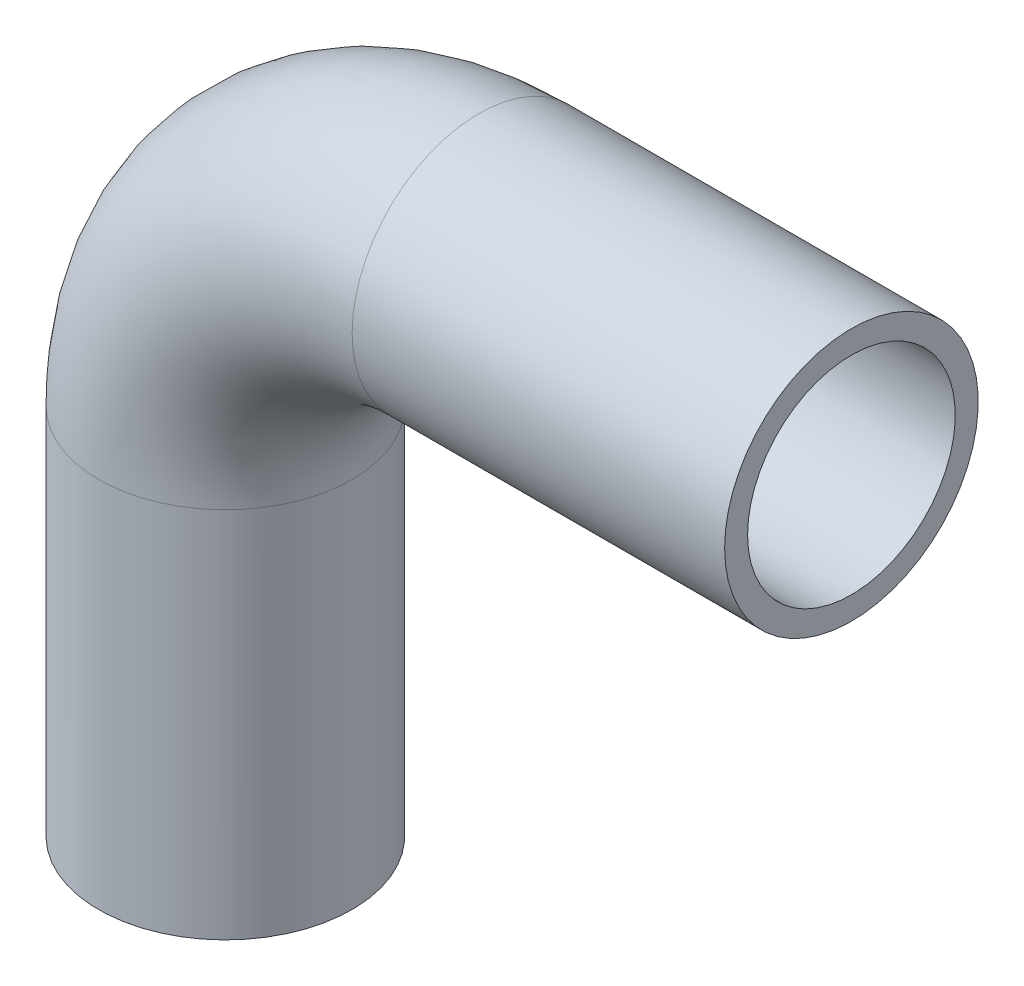
ISO-10303-21;
HEADER;
FILE_DESCRIPTION(('STEP AP214'),'2;1');
FILE_NAME('part.step','',(''),(''),'','','');
FILE_SCHEMA(('AUTOMOTIVE_DESIGN { 1 0 10303 214 1 1 1 1 }'));
ENDSEC;
DATA;
#1=APPLICATION_CONTEXT('core data for automotive mechanical design processes');
#2=APPLICATION_PROTOCOL_DEFINITION('international standard','automotive_design',2000,#1);
#3=PRODUCT_CONTEXT('',#1,'mechanical');
#4=PRODUCT('Part','Part','',(#3));
#5=PRODUCT_RELATED_PRODUCT_CATEGORY('part','',(#4));
#6=PRODUCT_DEFINITION_FORMATION('','',#4);
#7=PRODUCT_DEFINITION_CONTEXT('part definition',#1,'design');
#8=PRODUCT_DEFINITION('design','',#6,#7);
#9=PRODUCT_DEFINITION_SHAPE('','',#8);
#10=(LENGTH_UNIT() NAMED_UNIT(*) SI_UNIT(.MILLI.,.METRE.));
#11=(NAMED_UNIT(*) PLANE_ANGLE_UNIT() SI_UNIT($,.RADIAN.));
#12=(NAMED_UNIT(*) SI_UNIT($,.STERADIAN.) SOLID_ANGLE_UNIT());
#13=UNCERTAINTY_MEASURE_WITH_UNIT(LENGTH_MEASURE(1.E-05),#10,'distance_accuracy_value','');
#14=(GEOMETRIC_REPRESENTATION_CONTEXT(3) GLOBAL_UNCERTAINTY_ASSIGNED_CONTEXT((#13)) GLOBAL_UNIT_ASSIGNED_CONTEXT((#10,
#11,#12)) REPRESENTATION_CONTEXT('',''));
#15=CARTESIAN_POINT('',(0.,0.,0.));
#16=DIRECTION('',(0.,0.,1.));
#17=DIRECTION('',(1.,0.,0.));
#18=AXIS2_PLACEMENT_3D('',#15,#16,#17);
#19=CARTESIAN_POINT('',(32.,47.,0.));
#20=DIRECTION('',(0.,0.,1.));
#21=DIRECTION('',(1.,0.,0.));
#22=AXIS2_PLACEMENT_3D('',#19,#20,#21);
#23=TOROIDAL_SURFACE('',#22,32.,13.1);
#24=CARTESIAN_POINT('',(32.,79.,0.));
#25=DIRECTION('',(-1.,0.,0.));
#26=DIRECTION('',(0.,1.,0.));
#27=AXIS2_PLACEMENT_3D('',#24,#25,#26);
#28=CIRCLE('',#27,13.1);
#29=CARTESIAN_POINT('',(32.,92.1,0.));
#30=VERTEX_POINT('',#29);
#31=EDGE_CURVE('E33',#30,#30,#28,.T.);
#32=ORIENTED_EDGE('',*,*,#31,.F.);
#33=EDGE_LOOP('',(#32));
#34=FACE_BOUND('',#33,.T.);
#35=CARTESIAN_POINT('',(0.,47.,0.));
#36=DIRECTION('',(0.,-1.,0.));
#37=DIRECTION('',(-1.,0.,0.));
#38=AXIS2_PLACEMENT_3D('',#35,#36,#37);
#39=CIRCLE('',#38,13.1);
#40=CARTESIAN_POINT('',(-13.1,47.,0.));
#41=VERTEX_POINT('',#40);
#42=EDGE_CURVE('E31',#41,#41,#39,.F.);
#43=ORIENTED_EDGE('',*,*,#42,.F.);
#44=EDGE_LOOP('',(#43));
#45=FACE_BOUND('',#44,.T.);
#46=ADVANCED_FACE('F13',(#34,#45),#23,.F.);
#47=CARTESIAN_POINT('',(79.,79.,0.));
#48=DIRECTION('',(-1.,0.,0.));
#49=DIRECTION('',(0.,0.,1.));
#50=AXIS2_PLACEMENT_3D('',#47,#48,#49);
#51=CYLINDRICAL_SURFACE('',#50,13.1);
#52=CARTESIAN_POINT('',(79.,79.,0.));
#53=DIRECTION('',(-1.,0.,0.));
#54=DIRECTION('',(0.,0.,1.));
#55=AXIS2_PLACEMENT_3D('',#52,#53,#54);
#56=CIRCLE('',#55,13.1);
#57=CARTESIAN_POINT('',(79.,79.,13.1));
#58=VERTEX_POINT('',#57);
#59=EDGE_CURVE('E17',#58,#58,#56,.T.);
#60=ORIENTED_EDGE('',*,*,#59,.F.);
#61=EDGE_LOOP('',(#60));
#62=FACE_BOUND('',#61,.T.);
#63=ORIENTED_EDGE('',*,*,#31,.T.);
#64=EDGE_LOOP('',(#63));
#65=FACE_BOUND('',#64,.T.);
#66=ADVANCED_FACE('F52',(#62,#65),#51,.F.);
#67=CARTESIAN_POINT('',(0.,47.,0.));
#68=DIRECTION('',(0.,-1.,0.));
#69=DIRECTION('',(0.,0.,-1.));
#70=AXIS2_PLACEMENT_3D('',#67,#68,#69);
#71=CYLINDRICAL_SURFACE('',#70,13.1);
#72=ORIENTED_EDGE('',*,*,#42,.T.);
#73=EDGE_LOOP('',(#72));
#74=FACE_BOUND('',#73,.T.);
#75=CARTESIAN_POINT('',(0.,0.,0.));
#76=DIRECTION('',(0.,-1.,0.));
#77=DIRECTION('',(0.,0.,-1.));
#78=AXIS2_PLACEMENT_3D('',#75,#76,#77);
#79=CIRCLE('',#78,13.1);
#80=CARTESIAN_POINT('',(0.,0.,-13.1));
#81=VERTEX_POINT('',#80);
#82=EDGE_CURVE('E42',#81,#81,#79,.F.);
#83=ORIENTED_EDGE('',*,*,#82,.F.);
#84=EDGE_LOOP('',(#83));
#85=FACE_BOUND('',#84,.T.);
#86=ADVANCED_FACE('F55',(#74,#85),#71,.F.);
#87=CARTESIAN_POINT('',(79.,95.,16.1920021082993));
#88=DIRECTION('',(1.,0.,0.));
#89=DIRECTION('',(0.,-1.,0.));
#90=AXIS2_PLACEMENT_3D('',#87,#88,#89);
#91=PLANE('',#90);
#92=ORIENTED_EDGE('',*,*,#59,.T.);
#93=EDGE_LOOP('',(#92));
#94=FACE_BOUND('',#93,.T.);
#95=CARTESIAN_POINT('',(79.,79.,0.));
#96=DIRECTION('',(-1.,0.,0.));
#97=DIRECTION('',(0.,0.,1.));
#98=AXIS2_PLACEMENT_3D('',#95,#96,#97);
#99=CIRCLE('',#98,16.);
#100=CARTESIAN_POINT('',(79.,79.,16.));
#101=VERTEX_POINT('',#100);
#102=EDGE_CURVE('E40',#101,#101,#99,.T.);
#103=ORIENTED_EDGE('',*,*,#102,.F.);
#104=EDGE_LOOP('',(#103));
#105=FACE_BOUND('',#104,.T.);
#106=ADVANCED_FACE('F49',(#94,#105),#91,.T.);
#107=CARTESIAN_POINT('',(16.,0.,16.1920021083516));
#108=DIRECTION('',(0.,-1.,0.));
#109=DIRECTION('',(-1.,0.,0.));
#110=AXIS2_PLACEMENT_3D('',#107,#108,#109);
#111=PLANE('',#110);
#112=ORIENTED_EDGE('',*,*,#82,.T.);
#113=EDGE_LOOP('',(#112));
#114=FACE_BOUND('',#113,.T.);
#115=CARTESIAN_POINT('',(0.,0.,0.));
#116=DIRECTION('',(0.,-1.,0.));
#117=DIRECTION('',(0.,0.,-1.));
#118=AXIS2_PLACEMENT_3D('',#115,#116,#117);
#119=CIRCLE('',#118,16.);
#120=CARTESIAN_POINT('',(0.,0.,-16.));
#121=VERTEX_POINT('',#120);
#122=EDGE_CURVE('E26',#121,#121,#119,.F.);
#123=ORIENTED_EDGE('',*,*,#122,.F.);
#124=EDGE_LOOP('',(#123));
#125=FACE_BOUND('',#124,.T.);
#126=ADVANCED_FACE('F69',(#114,#125),#111,.T.);
#127=CARTESIAN_POINT('',(32.,79.,0.));
#128=DIRECTION('',(-1.,0.,0.));
#129=DIRECTION('',(0.,0.,1.));
#130=AXIS2_PLACEMENT_3D('',#127,#128,#129);
#131=CYLINDRICAL_SURFACE('',#130,16.);
#132=ORIENTED_EDGE('',*,*,#102,.T.);
#133=EDGE_LOOP('',(#132));
#134=FACE_BOUND('',#133,.T.);
#135=CARTESIAN_POINT('',(32.,79.,0.));
#136=DIRECTION('',(-1.,0.,0.));
#137=DIRECTION('',(0.,-1.,0.));
#138=AXIS2_PLACEMENT_3D('',#135,#136,#137);
#139=CIRCLE('',#138,16.);
#140=CARTESIAN_POINT('',(32.,63.,0.));
#141=VERTEX_POINT('',#140);
#142=EDGE_CURVE('E21',#141,#141,#139,.T.);
#143=ORIENTED_EDGE('',*,*,#142,.F.);
#144=EDGE_LOOP('',(#143));
#145=FACE_BOUND('',#144,.T.);
#146=ADVANCED_FACE('F79',(#134,#145),#131,.T.);
#147=CARTESIAN_POINT('',(0.,0.,0.));
#148=DIRECTION('',(0.,-1.,0.));
#149=DIRECTION('',(0.,0.,-1.));
#150=AXIS2_PLACEMENT_3D('',#147,#148,#149);
#151=CYLINDRICAL_SURFACE('',#150,16.);
#152=CARTESIAN_POINT('',(0.,47.,0.));
#153=DIRECTION('',(0.,-1.,0.));
#154=DIRECTION('',(1.,0.,0.));
#155=AXIS2_PLACEMENT_3D('',#152,#153,#154);
#156=CIRCLE('',#155,16.);
#157=CARTESIAN_POINT('',(16.,47.,0.));
#158=VERTEX_POINT('',#157);
#159=EDGE_CURVE('E8',#158,#158,#156,.F.);
#160=ORIENTED_EDGE('',*,*,#159,.F.);
#161=EDGE_LOOP('',(#160));
#162=FACE_BOUND('',#161,.T.);
#163=ORIENTED_EDGE('',*,*,#122,.T.);
#164=EDGE_LOOP('',(#163));
#165=FACE_BOUND('',#164,.T.);
#166=ADVANCED_FACE('F73',(#162,#165),#151,.T.);
#167=CARTESIAN_POINT('',(32.,47.,0.));
#168=DIRECTION('',(0.,0.,1.));
#169=DIRECTION('',(1.,0.,0.));
#170=AXIS2_PLACEMENT_3D('',#167,#168,#169);
#171=TOROIDAL_SURFACE('',#170,32.,16.);
#172=ORIENTED_EDGE('',*,*,#142,.T.);
#173=EDGE_LOOP('',(#172));
#174=FACE_BOUND('',#173,.T.);
#175=ORIENTED_EDGE('',*,*,#159,.T.);
#176=EDGE_LOOP('',(#175));
#177=FACE_BOUND('',#176,.T.);
#178=ADVANCED_FACE('F71',(#174,#177),#171,.T.);
#179=CLOSED_SHELL('',(#46,#66,#86,#106,#126,#146,#166,#178));
#180=MANIFOLD_SOLID_BREP('B1',#179);
#181=ADVANCED_BREP_SHAPE_REPRESENTATION('',(#18,#180),#14);
#182=SHAPE_DEFINITION_REPRESENTATION(#9,#181);
ENDSEC;
END-ISO-10303-21;
